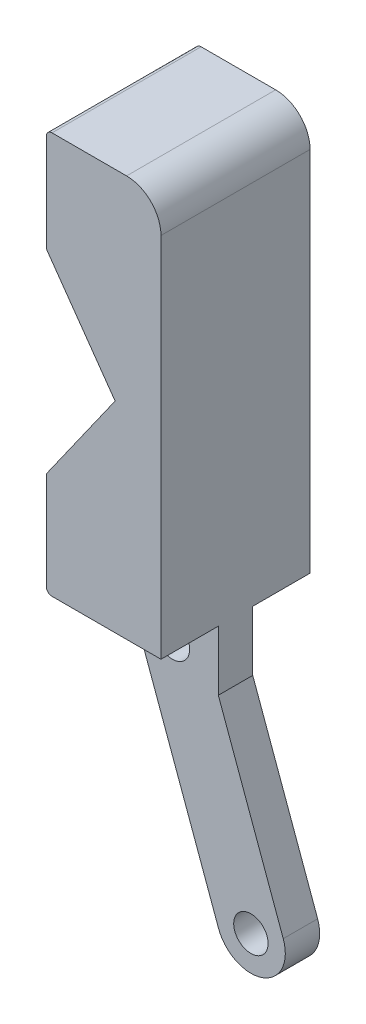
ISO-10303-21;
HEADER;
FILE_DESCRIPTION(('STEP AP214'),'2;1');
FILE_NAME('part.step','',(''),(''),'','','');
FILE_SCHEMA(('AUTOMOTIVE_DESIGN { 1 0 10303 214 1 1 1 1 }'));
ENDSEC;
DATA;
#1=APPLICATION_CONTEXT('core data for automotive mechanical design processes');
#2=APPLICATION_PROTOCOL_DEFINITION('international standard','automotive_design',2000,#1);
#3=PRODUCT_CONTEXT('',#1,'mechanical');
#4=PRODUCT('Part','Part','',(#3));
#5=PRODUCT_RELATED_PRODUCT_CATEGORY('part','',(#4));
#6=PRODUCT_DEFINITION_FORMATION('','',#4);
#7=PRODUCT_DEFINITION_CONTEXT('part definition',#1,'design');
#8=PRODUCT_DEFINITION('design','',#6,#7);
#9=PRODUCT_DEFINITION_SHAPE('','',#8);
#10=(LENGTH_UNIT() NAMED_UNIT(*) SI_UNIT(.MILLI.,.METRE.));
#11=(NAMED_UNIT(*) PLANE_ANGLE_UNIT() SI_UNIT($,.RADIAN.));
#12=(NAMED_UNIT(*) SI_UNIT($,.STERADIAN.) SOLID_ANGLE_UNIT());
#13=UNCERTAINTY_MEASURE_WITH_UNIT(LENGTH_MEASURE(1.E-05),#10,'distance_accuracy_value','');
#14=(GEOMETRIC_REPRESENTATION_CONTEXT(3) GLOBAL_UNCERTAINTY_ASSIGNED_CONTEXT((#13)) GLOBAL_UNIT_ASSIGNED_CONTEXT((#10,
#11,#12)) REPRESENTATION_CONTEXT('',''));
#15=CARTESIAN_POINT('',(0.,0.,0.));
#16=DIRECTION('',(0.,0.,1.));
#17=DIRECTION('',(1.,0.,0.));
#18=AXIS2_PLACEMENT_3D('',#15,#16,#17);
#19=CARTESIAN_POINT('',(0.,0.,-1.5));
#20=DIRECTION('',(0.,0.,1.));
#21=DIRECTION('',(1.,0.,0.));
#22=AXIS2_PLACEMENT_3D('',#19,#20,#21);
#23=CYLINDRICAL_SURFACE('',#22,3.);
#24=DIRECTION('',(0.,0.,1.));
#25=VECTOR('',#24,1.);
#26=CARTESIAN_POINT('',(2.81907786235772,1.02606042997702,-1.5));
#27=LINE('',#26,#25);
#28=CARTESIAN_POINT('',(2.81907786235772,1.02606042997702,-1.5));
#29=VERTEX_POINT('',#28);
#30=CARTESIAN_POINT('',(2.81907786235772,1.02606042997702,1.5));
#31=VERTEX_POINT('',#30);
#32=EDGE_CURVE('E267',#29,#31,#27,.T.);
#33=ORIENTED_EDGE('',*,*,#32,.T.);
#34=CARTESIAN_POINT('',(0.,0.,1.5));
#35=DIRECTION('',(0.,0.,1.));
#36=DIRECTION('',(1.,0.,0.));
#37=AXIS2_PLACEMENT_3D('',#34,#35,#36);
#38=CIRCLE('',#37,3.);
#39=CARTESIAN_POINT('',(-2.81907786235772,-1.02606042997702,1.5));
#40=VERTEX_POINT('',#39);
#41=EDGE_CURVE('E212',#40,#31,#38,.T.);
#42=ORIENTED_EDGE('',*,*,#41,.F.);
#43=DIRECTION('',(0.,0.,1.));
#44=VECTOR('',#43,1.);
#45=CARTESIAN_POINT('',(-2.81907786235772,-1.02606042997702,-1.5));
#46=LINE('',#45,#44);
#47=CARTESIAN_POINT('',(-2.81907786235772,-1.02606042997702,-1.5));
#48=VERTEX_POINT('',#47);
#49=EDGE_CURVE('E268',#48,#40,#46,.T.);
#50=ORIENTED_EDGE('',*,*,#49,.F.);
#51=CARTESIAN_POINT('',(0.,0.,-1.5));
#52=DIRECTION('',(0.,0.,1.));
#53=DIRECTION('',(1.,0.,0.));
#54=AXIS2_PLACEMENT_3D('',#51,#52,#53);
#55=CIRCLE('',#54,3.);
#56=EDGE_CURVE('E241',#48,#29,#55,.T.);
#57=ORIENTED_EDGE('',*,*,#56,.T.);
#58=EDGE_LOOP('',(#33,#42,#50,#57));
#59=FACE_BOUND('',#58,.T.);
#60=ADVANCED_FACE('F37',(#59),#23,.T.);
#61=CARTESIAN_POINT('',(-2.81907786235772,-1.02606042997702,-1.5));
#62=DIRECTION('',(0.939692620785907,0.342020143325673,0.));
#63=DIRECTION('',(-0.342020143325673,0.939692620785907,0.));
#64=AXIS2_PLACEMENT_3D('',#61,#62,#63);
#65=PLANE('',#64);
#66=ORIENTED_EDGE('',*,*,#49,.T.);
#67=DIRECTION('',(-0.342020143325673,0.939692620785907,0.));
#68=VECTOR('',#67,1.);
#69=CARTESIAN_POINT('',(-2.81907786235772,-1.02606042997702,1.5));
#70=LINE('',#69,#68);
#71=CARTESIAN_POINT('',(-9.65948072887129,17.7677919857414,1.5));
#72=VERTEX_POINT('',#71);
#73=EDGE_CURVE('E232',#40,#72,#70,.T.);
#74=ORIENTED_EDGE('',*,*,#73,.T.);
#75=DIRECTION('',(0.,0.,1.));
#76=VECTOR('',#75,1.);
#77=CARTESIAN_POINT('',(-9.65948072887129,17.7677919857414,-1.5));
#78=LINE('',#77,#76);
#79=CARTESIAN_POINT('',(-9.65948072887129,17.7677919857414,-1.5));
#80=VERTEX_POINT('',#79);
#81=EDGE_CURVE('E270',#80,#72,#78,.T.);
#82=ORIENTED_EDGE('',*,*,#81,.F.);
#83=DIRECTION('',(-0.342020143325673,0.939692620785907,0.));
#84=VECTOR('',#83,1.);
#85=CARTESIAN_POINT('',(-2.81907786235772,-1.02606042997702,-1.5));
#86=LINE('',#85,#84);
#87=EDGE_CURVE('E259',#48,#80,#86,.T.);
#88=ORIENTED_EDGE('',*,*,#87,.F.);
#89=EDGE_LOOP('',(#66,#74,#82,#88));
#90=FACE_BOUND('',#89,.T.);
#91=ADVANCED_FACE('F319',(#90),#65,.F.);
#92=CARTESIAN_POINT('',(-6.84040286651346,18.7938524157181,-1.5));
#93=DIRECTION('',(0.,0.,1.));
#94=DIRECTION('',(1.,0.,0.));
#95=AXIS2_PLACEMENT_3D('',#92,#93,#94);
#96=CYLINDRICAL_SURFACE('',#95,3.);
#97=ORIENTED_EDGE('',*,*,#81,.T.);
#98=CARTESIAN_POINT('',(-6.84040286651346,18.7938524157181,1.5));
#99=DIRECTION('',(0.,0.,1.));
#100=DIRECTION('',(1.,0.,0.));
#101=AXIS2_PLACEMENT_3D('',#98,#99,#100);
#102=CIRCLE('',#101,3.);
#103=CARTESIAN_POINT('',(-9.84040286651346,18.7938524157181,1.5));
#104=VERTEX_POINT('',#103);
#105=EDGE_CURVE('E229',#104,#72,#102,.T.);
#106=ORIENTED_EDGE('',*,*,#105,.F.);
#107=DIRECTION('',(0.,0.,1.));
#108=VECTOR('',#107,1.);
#109=CARTESIAN_POINT('',(-9.84040286651346,18.7938524157181,-1.5));
#110=LINE('',#109,#108);
#111=CARTESIAN_POINT('',(-9.84040286651346,18.7938524157181,-1.5));
#112=VERTEX_POINT('',#111);
#113=EDGE_CURVE('E272',#112,#104,#110,.T.);
#114=ORIENTED_EDGE('',*,*,#113,.F.);
#115=CARTESIAN_POINT('',(-6.84040286651346,18.7938524157181,-1.5));
#116=DIRECTION('',(0.,0.,1.));
#117=DIRECTION('',(1.,0.,0.));
#118=AXIS2_PLACEMENT_3D('',#115,#116,#117);
#119=CIRCLE('',#118,3.);
#120=EDGE_CURVE('E256',#112,#80,#119,.T.);
#121=ORIENTED_EDGE('',*,*,#120,.T.);
#122=EDGE_LOOP('',(#97,#106,#114,#121));
#123=FACE_BOUND('',#122,.T.);
#124=ADVANCED_FACE('F325',(#123),#96,.T.);
#125=CARTESIAN_POINT('',(-6.46948491238118,-1.09642049379347,-1.5));
#126=DIRECTION('',(-0.985941127991598,-0.167093064292495,0.));
#127=DIRECTION('',(0.167093064292495,-0.985941127991598,0.));
#128=AXIS2_PLACEMENT_3D('',#125,#126,#127);
#129=PLANE('',#128);
#130=ORIENTED_EDGE('',*,*,#113,.T.);
#131=DIRECTION('',(0.167093064292495,-0.985941127991598,0.));
#132=VECTOR('',#131,1.);
#133=CARTESIAN_POINT('',(-6.46948491238118,-1.09642049379347,1.5));
#134=LINE('',#133,#132);
#135=CARTESIAN_POINT('',(-10.3488299709782,21.7938524157181,1.5));
#136=VERTEX_POINT('',#135);
#137=EDGE_CURVE('E226',#136,#104,#134,.T.);
#138=ORIENTED_EDGE('',*,*,#137,.F.);
#139=DIRECTION('',(0.,0.,1.));
#140=VECTOR('',#139,1.);
#141=CARTESIAN_POINT('',(-10.3488299709782,21.7938524157181,-1.5));
#142=LINE('',#141,#140);
#143=CARTESIAN_POINT('',(-10.3488299709782,21.7938524157181,-1.5));
#144=VERTEX_POINT('',#143);
#145=EDGE_CURVE('E274',#144,#136,#142,.T.);
#146=ORIENTED_EDGE('',*,*,#145,.F.);
#147=DIRECTION('',(0.167093064292495,-0.985941127991598,0.));
#148=VECTOR('',#147,1.);
#149=CARTESIAN_POINT('',(-6.46948491238118,-1.09642049379347,-1.5));
#150=LINE('',#149,#148);
#151=EDGE_CURVE('E253',#144,#112,#150,.T.);
#152=ORIENTED_EDGE('',*,*,#151,.T.);
#153=EDGE_LOOP('',(#130,#138,#146,#152));
#154=FACE_BOUND('',#153,.T.);
#155=ADVANCED_FACE('F379',(#154),#129,.T.);
#156=CARTESIAN_POINT('',(-2.84040286651346,0.,-1.5));
#157=DIRECTION('',(1.,0.,0.));
#158=DIRECTION('',(0.,0.,-1.));
#159=AXIS2_PLACEMENT_3D('',#156,#157,#158);
#160=PLANE('',#159);
#161=DIRECTION('',(0.,1.,0.));
#162=VECTOR('',#161,1.);
#163=CARTESIAN_POINT('',(-2.84040286651346,0.,-6.5));
#164=LINE('',#163,#162);
#165=CARTESIAN_POINT('',(-2.84040286651346,21.7938524157181,-6.5));
#166=VERTEX_POINT('',#165);
#167=CARTESIAN_POINT('',(-2.84040286651346,53.7938524157184,-6.5));
#168=VERTEX_POINT('',#167);
#169=EDGE_CURVE('E196',#166,#168,#164,.T.);
#170=ORIENTED_EDGE('',*,*,#169,.T.);
#171=DIRECTION('',(0.,0.,1.));
#172=VECTOR('',#171,1.);
#173=CARTESIAN_POINT('',(-2.84040286651346,53.7938524157184,-1.5));
#174=LINE('',#173,#172);
#175=CARTESIAN_POINT('',(-2.84040286651346,53.7938524157184,6.5));
#176=VERTEX_POINT('',#175);
#177=EDGE_CURVE('E174',#168,#176,#174,.T.);
#178=ORIENTED_EDGE('',*,*,#177,.T.);
#179=DIRECTION('',(0.,1.,0.));
#180=VECTOR('',#179,1.);
#181=CARTESIAN_POINT('',(-2.84040286651346,0.,6.5));
#182=LINE('',#181,#180);
#183=CARTESIAN_POINT('',(-2.84040286651346,21.7938524157181,6.5));
#184=VERTEX_POINT('',#183);
#185=EDGE_CURVE('E170',#184,#176,#182,.T.);
#186=ORIENTED_EDGE('',*,*,#185,.F.);
#187=DIRECTION('',(0.,0.,1.));
#188=VECTOR('',#187,1.);
#189=CARTESIAN_POINT('',(-2.84040286651346,21.7938524157181,-6.5));
#190=LINE('',#189,#188);
#191=CARTESIAN_POINT('',(-2.84040286651346,21.7938524157181,1.5));
#192=VERTEX_POINT('',#191);
#193=EDGE_CURVE('E154',#192,#184,#190,.T.);
#194=ORIENTED_EDGE('',*,*,#193,.F.);
#195=DIRECTION('',(0.,1.,0.));
#196=VECTOR('',#195,1.);
#197=CARTESIAN_POINT('',(-2.84040286651346,0.,1.5));
#198=LINE('',#197,#196);
#199=CARTESIAN_POINT('',(-2.84040286651346,16.575355938389,1.5));
#200=VERTEX_POINT('',#199);
#201=EDGE_CURVE('E223',#200,#192,#198,.T.);
#202=ORIENTED_EDGE('',*,*,#201,.F.);
#203=DIRECTION('',(0.,0.,1.));
#204=VECTOR('',#203,1.);
#205=CARTESIAN_POINT('',(-2.84040286651346,16.575355938389,-1.5));
#206=LINE('',#205,#204);
#207=CARTESIAN_POINT('',(-2.84040286651346,16.575355938389,-1.5));
#208=VERTEX_POINT('',#207);
#209=EDGE_CURVE('E276',#208,#200,#206,.T.);
#210=ORIENTED_EDGE('',*,*,#209,.F.);
#211=DIRECTION('',(0.,1.,0.));
#212=VECTOR('',#211,1.);
#213=CARTESIAN_POINT('',(-2.84040286651346,0.,-1.5));
#214=LINE('',#213,#212);
#215=CARTESIAN_POINT('',(-2.84040286651346,21.7938524157181,-1.5));
#216=VERTEX_POINT('',#215);
#217=EDGE_CURVE('E247',#208,#216,#214,.T.);
#218=ORIENTED_EDGE('',*,*,#217,.T.);
#219=EDGE_CURVE('E165',#166,#216,#190,.T.);
#220=ORIENTED_EDGE('',*,*,#219,.F.);
#221=EDGE_LOOP('',(#170,#178,#186,#194,#202,#210,#218,#220));
#222=FACE_BOUND('',#221,.T.);
#223=ADVANCED_FACE('F172',(#222),#160,.T.);
#224=CARTESIAN_POINT('',(0.,0.,-1.5));
#225=DIRECTION('',(0.,0.,1.));
#226=DIRECTION('',(1.,0.,0.));
#227=AXIS2_PLACEMENT_3D('',#224,#225,#226);
#228=CYLINDRICAL_SURFACE('',#227,1.5);
#229=CARTESIAN_POINT('',(0.,0.,-1.5));
#230=DIRECTION('',(0.,0.,1.));
#231=DIRECTION('',(1.,0.,0.));
#232=AXIS2_PLACEMENT_3D('',#229,#230,#231);
#233=CIRCLE('',#232,1.5);
#234=CARTESIAN_POINT('',(1.5,0.,-1.5));
#235=VERTEX_POINT('',#234);
#236=EDGE_CURVE('E261',#235,#235,#233,.T.);
#237=ORIENTED_EDGE('',*,*,#236,.F.);
#238=EDGE_LOOP('',(#237));
#239=FACE_BOUND('',#238,.T.);
#240=CARTESIAN_POINT('',(0.,0.,1.5));
#241=DIRECTION('',(0.,0.,1.));
#242=DIRECTION('',(1.,0.,0.));
#243=AXIS2_PLACEMENT_3D('',#240,#241,#242);
#244=CIRCLE('',#243,1.5);
#245=CARTESIAN_POINT('',(1.5,0.,1.5));
#246=VERTEX_POINT('',#245);
#247=EDGE_CURVE('E235',#246,#246,#244,.T.);
#248=ORIENTED_EDGE('',*,*,#247,.T.);
#249=EDGE_LOOP('',(#248));
#250=FACE_BOUND('',#249,.T.);
#251=ADVANCED_FACE('F373',(#239,#250),#228,.F.);
#252=CARTESIAN_POINT('',(2.81907786235772,1.02606042997702,-1.5));
#253=DIRECTION('',(0.939692620785907,0.342020143325673,0.));
#254=DIRECTION('',(-0.342020143325673,0.939692620785907,0.));
#255=AXIS2_PLACEMENT_3D('',#252,#253,#254);
#256=PLANE('',#255);
#257=ORIENTED_EDGE('',*,*,#209,.T.);
#258=DIRECTION('',(-0.342020143325673,0.939692620785907,0.));
#259=VECTOR('',#258,1.);
#260=CARTESIAN_POINT('',(2.81907786235772,1.02606042997702,1.5));
#261=LINE('',#260,#259);
#262=EDGE_CURVE('E220',#31,#200,#261,.T.);
#263=ORIENTED_EDGE('',*,*,#262,.F.);
#264=ORIENTED_EDGE('',*,*,#32,.F.);
#265=DIRECTION('',(-0.342020143325673,0.939692620785907,0.));
#266=VECTOR('',#265,1.);
#267=CARTESIAN_POINT('',(2.81907786235772,1.02606042997702,-1.5));
#268=LINE('',#267,#266);
#269=EDGE_CURVE('E244',#29,#208,#268,.T.);
#270=ORIENTED_EDGE('',*,*,#269,.T.);
#271=EDGE_LOOP('',(#257,#263,#264,#270));
#272=FACE_BOUND('',#271,.T.);
#273=ADVANCED_FACE('F330',(#272),#256,.T.);
#274=CARTESIAN_POINT('',(-6.84040286651346,18.7938524157181,-1.5));
#275=DIRECTION('',(0.,0.,1.));
#276=DIRECTION('',(1.,0.,0.));
#277=AXIS2_PLACEMENT_3D('',#274,#275,#276);
#278=CYLINDRICAL_SURFACE('',#277,1.5);
#279=CARTESIAN_POINT('',(-6.84040286651346,18.7938524157181,-1.5));
#280=DIRECTION('',(0.,0.,1.));
#281=DIRECTION('',(1.,0.,0.));
#282=AXIS2_PLACEMENT_3D('',#279,#280,#281);
#283=CIRCLE('',#282,1.5);
#284=CARTESIAN_POINT('',(-5.34040286651346,18.7938524157181,-1.5));
#285=VERTEX_POINT('',#284);
#286=EDGE_CURVE('E264',#285,#285,#283,.T.);
#287=ORIENTED_EDGE('',*,*,#286,.F.);
#288=EDGE_LOOP('',(#287));
#289=FACE_BOUND('',#288,.T.);
#290=CARTESIAN_POINT('',(-6.84040286651346,18.7938524157181,1.5));
#291=DIRECTION('',(0.,0.,1.));
#292=DIRECTION('',(1.,0.,0.));
#293=AXIS2_PLACEMENT_3D('',#290,#291,#292);
#294=CIRCLE('',#293,1.5);
#295=CARTESIAN_POINT('',(-5.34040286651346,18.7938524157181,1.5));
#296=VERTEX_POINT('',#295);
#297=EDGE_CURVE('E238',#296,#296,#294,.T.);
#298=ORIENTED_EDGE('',*,*,#297,.T.);
#299=EDGE_LOOP('',(#298));
#300=FACE_BOUND('',#299,.T.);
#301=ADVANCED_FACE('F368',(#289,#300),#278,.F.);
#302=CARTESIAN_POINT('',(0.,0.,-1.5));
#303=DIRECTION('',(0.,0.,1.));
#304=DIRECTION('',(1.,0.,0.));
#305=AXIS2_PLACEMENT_3D('',#302,#303,#304);
#306=PLANE('',#305);
#307=ORIENTED_EDGE('',*,*,#56,.F.);
#308=ORIENTED_EDGE('',*,*,#87,.T.);
#309=ORIENTED_EDGE('',*,*,#120,.F.);
#310=ORIENTED_EDGE('',*,*,#151,.F.);
#311=DIRECTION('',(1.,0.,0.));
#312=VECTOR('',#311,1.);
#313=CARTESIAN_POINT('',(0.,21.7938524157182,-1.5));
#314=LINE('',#313,#312);
#315=EDGE_CURVE('E250',#144,#216,#314,.T.);
#316=ORIENTED_EDGE('',*,*,#315,.T.);
#317=ORIENTED_EDGE('',*,*,#217,.F.);
#318=ORIENTED_EDGE('',*,*,#269,.F.);
#319=EDGE_LOOP('',(#307,#308,#309,#310,#316,#317,#318));
#320=FACE_BOUND('',#319,.T.);
#321=ORIENTED_EDGE('',*,*,#236,.T.);
#322=EDGE_LOOP('',(#321));
#323=FACE_BOUND('',#322,.T.);
#324=ORIENTED_EDGE('',*,*,#286,.T.);
#325=EDGE_LOOP('',(#324));
#326=FACE_BOUND('',#325,.T.);
#327=ADVANCED_FACE('F364',(#320,#323,#326),#306,.F.);
#328=CARTESIAN_POINT('',(0.,0.,1.5));
#329=DIRECTION('',(0.,0.,1.));
#330=DIRECTION('',(1.,0.,0.));
#331=AXIS2_PLACEMENT_3D('',#328,#329,#330);
#332=PLANE('',#331);
#333=ORIENTED_EDGE('',*,*,#41,.T.);
#334=ORIENTED_EDGE('',*,*,#262,.T.);
#335=ORIENTED_EDGE('',*,*,#201,.T.);
#336=DIRECTION('',(1.,0.,0.));
#337=VECTOR('',#336,1.);
#338=CARTESIAN_POINT('',(0.,21.7938524157182,1.5));
#339=LINE('',#338,#337);
#340=EDGE_CURVE('E161',#136,#192,#339,.T.);
#341=ORIENTED_EDGE('',*,*,#340,.F.);
#342=ORIENTED_EDGE('',*,*,#137,.T.);
#343=ORIENTED_EDGE('',*,*,#105,.T.);
#344=ORIENTED_EDGE('',*,*,#73,.F.);
#345=EDGE_LOOP('',(#333,#334,#335,#341,#342,#343,#344));
#346=FACE_BOUND('',#345,.T.);
#347=ORIENTED_EDGE('',*,*,#247,.F.);
#348=EDGE_LOOP('',(#347));
#349=FACE_BOUND('',#348,.T.);
#350=ORIENTED_EDGE('',*,*,#297,.F.);
#351=EDGE_LOOP('',(#350));
#352=FACE_BOUND('',#351,.T.);
#353=ADVANCED_FACE('F361',(#346,#349,#352),#332,.T.);
#354=CARTESIAN_POINT('',(0.,21.7938524157181,-6.5));
#355=DIRECTION('',(0.,1.,0.));
#356=DIRECTION('',(0.,0.,1.));
#357=AXIS2_PLACEMENT_3D('',#354,#355,#356);
#358=PLANE('',#357);
#359=DIRECTION('',(-1.,0.,0.));
#360=VECTOR('',#359,1.);
#361=CARTESIAN_POINT('',(0.,21.7938524157181,6.5));
#362=LINE('',#361,#360);
#363=CARTESIAN_POINT('',(-12.3404028665135,21.7938524157181,6.5));
#364=VERTEX_POINT('',#363);
#365=EDGE_CURVE('E158',#184,#364,#362,.T.);
#366=ORIENTED_EDGE('',*,*,#365,.T.);
#367=DIRECTION('',(0.,0.,1.));
#368=VECTOR('',#367,1.);
#369=CARTESIAN_POINT('',(-12.3404028665135,21.7938524157181,-6.5));
#370=LINE('',#369,#368);
#371=CARTESIAN_POINT('',(-12.3404028665135,21.7938524157181,-6.5));
#372=VERTEX_POINT('',#371);
#373=EDGE_CURVE('E290',#364,#372,#370,.F.);
#374=ORIENTED_EDGE('',*,*,#373,.T.);
#375=DIRECTION('',(-1.,0.,0.));
#376=VECTOR('',#375,1.);
#377=CARTESIAN_POINT('',(0.,21.7938524157181,-6.5));
#378=LINE('',#377,#376);
#379=EDGE_CURVE('E193',#166,#372,#378,.T.);
#380=ORIENTED_EDGE('',*,*,#379,.F.);
#381=ORIENTED_EDGE('',*,*,#219,.T.);
#382=ORIENTED_EDGE('',*,*,#315,.F.);
#383=ORIENTED_EDGE('',*,*,#145,.T.);
#384=ORIENTED_EDGE('',*,*,#340,.T.);
#385=ORIENTED_EDGE('',*,*,#193,.T.);
#386=EDGE_LOOP('',(#366,#374,#380,#381,#382,#383,#384,#385));
#387=FACE_BOUND('',#386,.T.);
#388=ADVANCED_FACE('F156',(#387),#358,.F.);
#389=CARTESIAN_POINT('',(-12.8404028665134,0.,-6.5));
#390=DIRECTION('',(1.,0.,0.));
#391=DIRECTION('',(0.,1.,0.));
#392=AXIS2_PLACEMENT_3D('',#389,#390,#391);
#393=PLANE('',#392);
#394=DIRECTION('',(0.,1.,0.));
#395=VECTOR('',#394,1.);
#396=CARTESIAN_POINT('',(-12.8404028665134,0.,-6.5));
#397=LINE('',#396,#395);
#398=CARTESIAN_POINT('',(-12.8404028665135,22.2938524157181,-6.5));
#399=VERTEX_POINT('',#398);
#400=CARTESIAN_POINT('',(-12.8404028665135,30.7938524157184,-6.5));
#401=VERTEX_POINT('',#400);
#402=EDGE_CURVE('E166',#399,#401,#397,.T.);
#403=ORIENTED_EDGE('',*,*,#402,.F.);
#404=DIRECTION('',(0.,0.,1.));
#405=VECTOR('',#404,1.);
#406=CARTESIAN_POINT('',(-12.8404028665135,22.2938524157181,-6.5));
#407=LINE('',#406,#405);
#408=CARTESIAN_POINT('',(-12.8404028665135,22.2938524157181,6.5));
#409=VERTEX_POINT('',#408);
#410=EDGE_CURVE('E286',#399,#409,#407,.T.);
#411=ORIENTED_EDGE('',*,*,#410,.T.);
#412=DIRECTION('',(0.,1.,0.));
#413=VECTOR('',#412,1.);
#414=CARTESIAN_POINT('',(-12.8404028665134,0.,6.5));
#415=LINE('',#414,#413);
#416=CARTESIAN_POINT('',(-12.8404028665135,30.7938524157184,6.5));
#417=VERTEX_POINT('',#416);
#418=EDGE_CURVE('E191',#409,#417,#415,.T.);
#419=ORIENTED_EDGE('',*,*,#418,.T.);
#420=DIRECTION('',(0.,0.,1.));
#421=VECTOR('',#420,1.);
#422=CARTESIAN_POINT('',(-12.8404028665135,30.7938524157184,-6.5));
#423=LINE('',#422,#421);
#424=EDGE_CURVE('E209',#401,#417,#423,.T.);
#425=ORIENTED_EDGE('',*,*,#424,.F.);
#426=EDGE_LOOP('',(#403,#411,#419,#425));
#427=FACE_BOUND('',#426,.T.);
#428=ADVANCED_FACE('F342',(#427),#393,.F.);
#429=CARTESIAN_POINT('',(-23.0781115963717,16.2904317150859,-6.5));
#430=DIRECTION('',(0.816967863264762,-0.576683197598655,0.));
#431=DIRECTION('',(0.576683197598655,0.816967863264762,0.));
#432=AXIS2_PLACEMENT_3D('',#429,#430,#431);
#433=PLANE('',#432);
#434=ORIENTED_EDGE('',*,*,#424,.T.);
#435=DIRECTION('',(0.576683197598655,0.816967863264762,0.));
#436=VECTOR('',#435,1.);
#437=CARTESIAN_POINT('',(-23.0781115963717,16.2904317150859,6.5));
#438=LINE('',#437,#436);
#439=CARTESIAN_POINT('',(-6.84040286651346,39.2938524157184,6.5));
#440=VERTEX_POINT('',#439);
#441=EDGE_CURVE('E188',#417,#440,#438,.T.);
#442=ORIENTED_EDGE('',*,*,#441,.T.);
#443=DIRECTION('',(0.,0.,1.));
#444=VECTOR('',#443,1.);
#445=CARTESIAN_POINT('',(-6.84040286651346,39.2938524157184,-6.5));
#446=LINE('',#445,#444);
#447=CARTESIAN_POINT('',(-6.84040286651346,39.2938524157184,-6.5));
#448=VERTEX_POINT('',#447);
#449=EDGE_CURVE('E213',#448,#440,#446,.T.);
#450=ORIENTED_EDGE('',*,*,#449,.F.);
#451=DIRECTION('',(0.576683197598655,0.816967863264762,0.));
#452=VECTOR('',#451,1.);
#453=CARTESIAN_POINT('',(-23.0781115963717,16.2904317150859,-6.5));
#454=LINE('',#453,#452);
#455=EDGE_CURVE('E206',#401,#448,#454,.T.);
#456=ORIENTED_EDGE('',*,*,#455,.F.);
#457=EDGE_LOOP('',(#434,#442,#450,#456));
#458=FACE_BOUND('',#457,.T.);
#459=ADVANCED_FACE('F345',(#458),#433,.F.);
#460=CARTESIAN_POINT('',(13.9470426429196,9.84497127735498,-6.5));
#461=DIRECTION('',(-0.816967863264762,-0.576683197598655,0.));
#462=DIRECTION('',(0.576683197598655,-0.816967863264762,0.));
#463=AXIS2_PLACEMENT_3D('',#460,#461,#462);
#464=PLANE('',#463);
#465=ORIENTED_EDGE('',*,*,#449,.T.);
#466=DIRECTION('',(0.576683197598655,-0.816967863264762,0.));
#467=VECTOR('',#466,1.);
#468=CARTESIAN_POINT('',(13.9470426429196,9.84497127735498,6.5));
#469=LINE('',#468,#467);
#470=CARTESIAN_POINT('',(-12.8404028665135,47.7938524157184,6.5));
#471=VERTEX_POINT('',#470);
#472=EDGE_CURVE('E185',#471,#440,#469,.T.);
#473=ORIENTED_EDGE('',*,*,#472,.F.);
#474=DIRECTION('',(0.,0.,1.));
#475=VECTOR('',#474,1.);
#476=CARTESIAN_POINT('',(-12.8404028665135,47.7938524157184,-6.5));
#477=LINE('',#476,#475);
#478=CARTESIAN_POINT('',(-12.8404028665135,47.7938524157184,-6.5));
#479=VERTEX_POINT('',#478);
#480=EDGE_CURVE('E215',#479,#471,#477,.T.);
#481=ORIENTED_EDGE('',*,*,#480,.F.);
#482=DIRECTION('',(0.576683197598655,-0.816967863264762,0.));
#483=VECTOR('',#482,1.);
#484=CARTESIAN_POINT('',(13.9470426429196,9.84497127735498,-6.5));
#485=LINE('',#484,#483);
#486=EDGE_CURVE('E203',#479,#448,#485,.T.);
#487=ORIENTED_EDGE('',*,*,#486,.T.);
#488=EDGE_LOOP('',(#465,#473,#481,#487));
#489=FACE_BOUND('',#488,.T.);
#490=ADVANCED_FACE('F349',(#489),#464,.T.);
#491=CARTESIAN_POINT('',(-12.8404028665135,0.,-6.5));
#492=DIRECTION('',(-1.,0.,0.));
#493=DIRECTION('',(0.,-1.,0.));
#494=AXIS2_PLACEMENT_3D('',#491,#492,#493);
#495=PLANE('',#494);
#496=DIRECTION('',(0.,-1.,0.));
#497=VECTOR('',#496,1.);
#498=CARTESIAN_POINT('',(-12.8404028665135,0.,6.5));
#499=LINE('',#498,#497);
#500=CARTESIAN_POINT('',(-12.8404028665135,56.2938524157184,6.5));
#501=VERTEX_POINT('',#500);
#502=EDGE_CURVE('E183',#501,#471,#499,.T.);
#503=ORIENTED_EDGE('',*,*,#502,.F.);
#504=DIRECTION('',(0.,0.,1.));
#505=VECTOR('',#504,1.);
#506=CARTESIAN_POINT('',(-12.8404028665135,56.2938524157184,-6.5));
#507=LINE('',#506,#505);
#508=CARTESIAN_POINT('',(-12.8404028665135,56.2938524157184,-6.5));
#509=VERTEX_POINT('',#508);
#510=EDGE_CURVE('E45',#501,#509,#507,.F.);
#511=ORIENTED_EDGE('',*,*,#510,.T.);
#512=DIRECTION('',(0.,-1.,0.));
#513=VECTOR('',#512,1.);
#514=CARTESIAN_POINT('',(-12.8404028665135,0.,-6.5));
#515=LINE('',#514,#513);
#516=EDGE_CURVE('E201',#509,#479,#515,.T.);
#517=ORIENTED_EDGE('',*,*,#516,.T.);
#518=ORIENTED_EDGE('',*,*,#480,.T.);
#519=EDGE_LOOP('',(#503,#511,#517,#518));
#520=FACE_BOUND('',#519,.T.);
#521=ADVANCED_FACE('F353',(#520),#495,.T.);
#522=CARTESIAN_POINT('',(0.,56.7938524157184,-6.5));
#523=DIRECTION('',(0.,1.,0.));
#524=DIRECTION('',(-1.,0.,0.));
#525=AXIS2_PLACEMENT_3D('',#522,#523,#524);
#526=PLANE('',#525);
#527=DIRECTION('',(-1.,0.,0.));
#528=VECTOR('',#527,1.);
#529=CARTESIAN_POINT('',(0.,56.7938524157184,-6.5));
#530=LINE('',#529,#528);
#531=CARTESIAN_POINT('',(-5.84040286651346,56.7938524157184,-6.5));
#532=VERTEX_POINT('',#531);
#533=CARTESIAN_POINT('',(-12.3404028665135,56.7938524157184,-6.5));
#534=VERTEX_POINT('',#533);
#535=EDGE_CURVE('E198',#532,#534,#530,.T.);
#536=ORIENTED_EDGE('',*,*,#535,.T.);
#537=DIRECTION('',(0.,0.,1.));
#538=VECTOR('',#537,1.);
#539=CARTESIAN_POINT('',(-12.3404028665135,56.7938524157184,-6.5));
#540=LINE('',#539,#538);
#541=CARTESIAN_POINT('',(-12.3404028665135,56.7938524157184,6.5));
#542=VERTEX_POINT('',#541);
#543=EDGE_CURVE('E294',#534,#542,#540,.T.);
#544=ORIENTED_EDGE('',*,*,#543,.T.);
#545=DIRECTION('',(-1.,0.,0.));
#546=VECTOR('',#545,1.);
#547=CARTESIAN_POINT('',(0.,56.7938524157184,6.5));
#548=LINE('',#547,#546);
#549=CARTESIAN_POINT('',(-5.84040286651346,56.7938524157184,6.5));
#550=VERTEX_POINT('',#549);
#551=EDGE_CURVE('E175',#550,#542,#548,.T.);
#552=ORIENTED_EDGE('',*,*,#551,.F.);
#553=DIRECTION('',(0.,0.,1.));
#554=VECTOR('',#553,1.);
#555=CARTESIAN_POINT('',(-5.84040286651346,56.7938524157184,-6.5));
#556=LINE('',#555,#554);
#557=EDGE_CURVE('E282',#550,#532,#556,.F.);
#558=ORIENTED_EDGE('',*,*,#557,.T.);
#559=EDGE_LOOP('',(#536,#544,#552,#558));
#560=FACE_BOUND('',#559,.T.);
#561=ADVANCED_FACE('F300',(#560),#526,.T.);
#562=CARTESIAN_POINT('',(0.,0.,-6.5));
#563=DIRECTION('',(0.,0.,1.));
#564=DIRECTION('',(1.,0.,0.));
#565=AXIS2_PLACEMENT_3D('',#562,#563,#564);
#566=PLANE('',#565);
#567=ORIENTED_EDGE('',*,*,#516,.F.);
#568=CARTESIAN_POINT('',(-12.3404028665135,56.2938524157184,-6.5));
#569=DIRECTION('',(0.,0.,1.));
#570=DIRECTION('',(1.,0.,0.));
#571=AXIS2_PLACEMENT_3D('',#568,#569,#570);
#572=CIRCLE('',#571,0.5);
#573=EDGE_CURVE('E11',#509,#534,#572,.F.);
#574=ORIENTED_EDGE('',*,*,#573,.T.);
#575=ORIENTED_EDGE('',*,*,#535,.F.);
#576=CARTESIAN_POINT('',(-5.84040286651346,53.7938524157184,-6.5));
#577=DIRECTION('',(0.,0.,1.));
#578=DIRECTION('',(1.,0.,0.));
#579=AXIS2_PLACEMENT_3D('',#576,#577,#578);
#580=CIRCLE('',#579,3.);
#581=EDGE_CURVE('E284',#532,#168,#580,.F.);
#582=ORIENTED_EDGE('',*,*,#581,.T.);
#583=ORIENTED_EDGE('',*,*,#169,.F.);
#584=ORIENTED_EDGE('',*,*,#379,.T.);
#585=CARTESIAN_POINT('',(-12.3404028665135,22.2938524157181,-6.5));
#586=DIRECTION('',(0.,0.,1.));
#587=DIRECTION('',(1.,0.,0.));
#588=AXIS2_PLACEMENT_3D('',#585,#586,#587);
#589=CIRCLE('',#588,0.5);
#590=EDGE_CURVE('E292',#372,#399,#589,.F.);
#591=ORIENTED_EDGE('',*,*,#590,.T.);
#592=ORIENTED_EDGE('',*,*,#402,.T.);
#593=ORIENTED_EDGE('',*,*,#455,.T.);
#594=ORIENTED_EDGE('',*,*,#486,.F.);
#595=EDGE_LOOP('',(#567,#574,#575,#582,#583,#584,#591,#592,#593,#594));
#596=FACE_BOUND('',#595,.T.);
#597=ADVANCED_FACE('F309',(#596),#566,.F.);
#598=CARTESIAN_POINT('',(0.,0.,6.5));
#599=DIRECTION('',(0.,0.,1.));
#600=DIRECTION('',(1.,0.,0.));
#601=AXIS2_PLACEMENT_3D('',#598,#599,#600);
#602=PLANE('',#601);
#603=ORIENTED_EDGE('',*,*,#551,.T.);
#604=CARTESIAN_POINT('',(-12.3404028665135,56.2938524157184,6.5));
#605=DIRECTION('',(0.,0.,1.));
#606=DIRECTION('',(1.,0.,0.));
#607=AXIS2_PLACEMENT_3D('',#604,#605,#606);
#608=CIRCLE('',#607,0.5);
#609=EDGE_CURVE('E59',#542,#501,#608,.T.);
#610=ORIENTED_EDGE('',*,*,#609,.T.);
#611=ORIENTED_EDGE('',*,*,#502,.T.);
#612=ORIENTED_EDGE('',*,*,#472,.T.);
#613=ORIENTED_EDGE('',*,*,#441,.F.);
#614=ORIENTED_EDGE('',*,*,#418,.F.);
#615=CARTESIAN_POINT('',(-12.3404028665135,22.2938524157181,6.5));
#616=DIRECTION('',(0.,0.,1.));
#617=DIRECTION('',(1.,0.,0.));
#618=AXIS2_PLACEMENT_3D('',#615,#616,#617);
#619=CIRCLE('',#618,0.5);
#620=EDGE_CURVE('E179',#409,#364,#619,.T.);
#621=ORIENTED_EDGE('',*,*,#620,.T.);
#622=ORIENTED_EDGE('',*,*,#365,.F.);
#623=ORIENTED_EDGE('',*,*,#185,.T.);
#624=CARTESIAN_POINT('',(-5.84040286651346,53.7938524157184,6.5));
#625=DIRECTION('',(0.,0.,1.));
#626=DIRECTION('',(1.,0.,0.));
#627=AXIS2_PLACEMENT_3D('',#624,#625,#626);
#628=CIRCLE('',#627,3.);
#629=EDGE_CURVE('E280',#176,#550,#628,.T.);
#630=ORIENTED_EDGE('',*,*,#629,.T.);
#631=EDGE_LOOP('',(#603,#610,#611,#612,#613,#614,#621,#622,#623,#630));
#632=FACE_BOUND('',#631,.T.);
#633=ADVANCED_FACE('F177',(#632),#602,.T.);
#634=CARTESIAN_POINT('',(-5.84040286651346,53.7938524157184,-1.5));
#635=DIRECTION('',(0.,0.,1.));
#636=DIRECTION('',(1.,0.,0.));
#637=AXIS2_PLACEMENT_3D('',#634,#635,#636);
#638=CYLINDRICAL_SURFACE('',#637,3.);
#639=ORIENTED_EDGE('',*,*,#581,.F.);
#640=ORIENTED_EDGE('',*,*,#557,.F.);
#641=ORIENTED_EDGE('',*,*,#629,.F.);
#642=ORIENTED_EDGE('',*,*,#177,.F.);
#643=EDGE_LOOP('',(#639,#640,#641,#642));
#644=FACE_BOUND('',#643,.T.);
#645=ADVANCED_FACE('F307',(#644),#638,.T.);
#646=CARTESIAN_POINT('',(-12.3404028665135,22.2938524157181,-6.5));
#647=DIRECTION('',(0.,0.,1.));
#648=DIRECTION('',(1.,0.,0.));
#649=AXIS2_PLACEMENT_3D('',#646,#647,#648);
#650=CYLINDRICAL_SURFACE('',#649,0.5);
#651=ORIENTED_EDGE('',*,*,#590,.F.);
#652=ORIENTED_EDGE('',*,*,#373,.F.);
#653=ORIENTED_EDGE('',*,*,#620,.F.);
#654=ORIENTED_EDGE('',*,*,#410,.F.);
#655=EDGE_LOOP('',(#651,#652,#653,#654));
#656=FACE_BOUND('',#655,.T.);
#657=ADVANCED_FACE('F313',(#656),#650,.T.);
#658=CARTESIAN_POINT('',(-12.3404028665135,56.2938524157184,-6.5));
#659=DIRECTION('',(0.,0.,1.));
#660=DIRECTION('',(1.,0.,0.));
#661=AXIS2_PLACEMENT_3D('',#658,#659,#660);
#662=CYLINDRICAL_SURFACE('',#661,0.5);
#663=ORIENTED_EDGE('',*,*,#573,.F.);
#664=ORIENTED_EDGE('',*,*,#510,.F.);
#665=ORIENTED_EDGE('',*,*,#609,.F.);
#666=ORIENTED_EDGE('',*,*,#543,.F.);
#667=EDGE_LOOP('',(#663,#664,#665,#666));
#668=FACE_BOUND('',#667,.T.);
#669=ADVANCED_FACE('F39',(#668),#662,.T.);
#670=CLOSED_SHELL('',(#60,#91,#124,#155,#223,#251,#273,#301,#327,#353,#388,#428,#459,#490,#521,
#561,#597,#633,#645,#657,#669));
#671=MANIFOLD_SOLID_BREP('B2',#670);
#672=ADVANCED_BREP_SHAPE_REPRESENTATION('',(#18,#671),#14);
#673=SHAPE_DEFINITION_REPRESENTATION(#9,#672);
ENDSEC;
END-ISO-10303-21;
